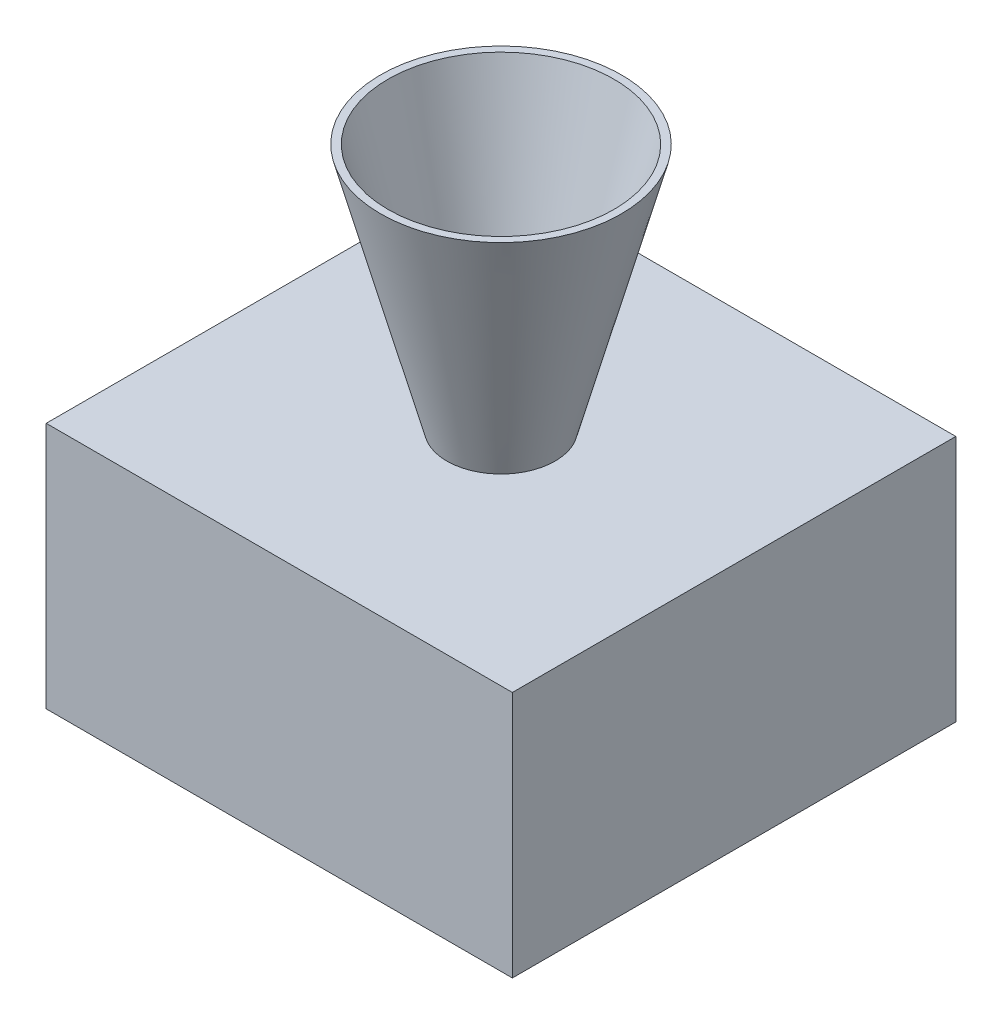
ISO-10303-21;
HEADER;
FILE_DESCRIPTION(('STEP AP214'),'2;1');
FILE_NAME('part.step','',(''),(''),'','','');
FILE_SCHEMA(('AUTOMOTIVE_DESIGN { 1 0 10303 214 1 1 1 1 }'));
ENDSEC;
DATA;
#1=APPLICATION_CONTEXT('core data for automotive mechanical design processes');
#2=APPLICATION_PROTOCOL_DEFINITION('international standard','automotive_design',2000,#1);
#3=PRODUCT_CONTEXT('',#1,'mechanical');
#4=PRODUCT('Part','Part','',(#3));
#5=PRODUCT_RELATED_PRODUCT_CATEGORY('part','',(#4));
#6=PRODUCT_DEFINITION_FORMATION('','',#4);
#7=PRODUCT_DEFINITION_CONTEXT('part definition',#1,'design');
#8=PRODUCT_DEFINITION('design','',#6,#7);
#9=PRODUCT_DEFINITION_SHAPE('','',#8);
#10=(LENGTH_UNIT() NAMED_UNIT(*) SI_UNIT(.MILLI.,.METRE.));
#11=(NAMED_UNIT(*) PLANE_ANGLE_UNIT() SI_UNIT($,.RADIAN.));
#12=(NAMED_UNIT(*) SI_UNIT($,.STERADIAN.) SOLID_ANGLE_UNIT());
#13=UNCERTAINTY_MEASURE_WITH_UNIT(LENGTH_MEASURE(1.E-05),#10,'distance_accuracy_value','');
#14=(GEOMETRIC_REPRESENTATION_CONTEXT(3) GLOBAL_UNCERTAINTY_ASSIGNED_CONTEXT((#13)) GLOBAL_UNIT_ASSIGNED_CONTEXT((#10,
#11,#12)) REPRESENTATION_CONTEXT('',''));
#15=CARTESIAN_POINT('',(0.,0.,0.));
#16=DIRECTION('',(0.,0.,1.));
#17=DIRECTION('',(1.,0.,0.));
#18=AXIS2_PLACEMENT_3D('',#15,#16,#17);
#19=CARTESIAN_POINT('',(-82.,87.,-78.));
#20=DIRECTION('',(1.,0.,0.));
#21=DIRECTION('',(0.,0.,-1.));
#22=AXIS2_PLACEMENT_3D('',#19,#20,#21);
#23=PLANE('',#22);
#24=DIRECTION('',(0.,0.,1.));
#25=VECTOR('',#24,1.);
#26=CARTESIAN_POINT('',(-82.,0.,-78.));
#27=LINE('',#26,#25);
#28=CARTESIAN_POINT('',(-82.,0.,-78.));
#29=VERTEX_POINT('',#28);
#30=CARTESIAN_POINT('',(-82.,0.,78.));
#31=VERTEX_POINT('',#30);
#32=EDGE_CURVE('E167',#29,#31,#27,.T.);
#33=ORIENTED_EDGE('',*,*,#32,.T.);
#34=DIRECTION('',(0.,-1.,0.));
#35=VECTOR('',#34,1.);
#36=CARTESIAN_POINT('',(-82.,87.,78.));
#37=LINE('',#36,#35);
#38=CARTESIAN_POINT('',(-82.,87.,78.));
#39=VERTEX_POINT('',#38);
#40=EDGE_CURVE('E43',#39,#31,#37,.T.);
#41=ORIENTED_EDGE('',*,*,#40,.F.);
#42=DIRECTION('',(0.,0.,1.));
#43=VECTOR('',#42,1.);
#44=CARTESIAN_POINT('',(-82.,87.,-78.));
#45=LINE('',#44,#43);
#46=CARTESIAN_POINT('',(-82.,87.,-78.));
#47=VERTEX_POINT('',#46);
#48=EDGE_CURVE('E168',#47,#39,#45,.T.);
#49=ORIENTED_EDGE('',*,*,#48,.F.);
#50=DIRECTION('',(0.,-1.,0.));
#51=VECTOR('',#50,1.);
#52=CARTESIAN_POINT('',(-82.,87.,-78.));
#53=LINE('',#52,#51);
#54=EDGE_CURVE('E58',#47,#29,#53,.T.);
#55=ORIENTED_EDGE('',*,*,#54,.T.);
#56=EDGE_LOOP('',(#33,#41,#49,#55));
#57=FACE_BOUND('',#56,.T.);
#58=ADVANCED_FACE('F40',(#57),#23,.F.);
#59=CARTESIAN_POINT('',(-82.,87.,78.));
#60=DIRECTION('',(0.,0.,-1.));
#61=DIRECTION('',(-1.,0.,0.));
#62=AXIS2_PLACEMENT_3D('',#59,#60,#61);
#63=PLANE('',#62);
#64=DIRECTION('',(1.,0.,0.));
#65=VECTOR('',#64,1.);
#66=CARTESIAN_POINT('',(-82.,0.,78.));
#67=LINE('',#66,#65);
#68=CARTESIAN_POINT('',(82.,0.,78.));
#69=VERTEX_POINT('',#68);
#70=EDGE_CURVE('E183',#31,#69,#67,.T.);
#71=ORIENTED_EDGE('',*,*,#70,.T.);
#72=DIRECTION('',(0.,-1.,0.));
#73=VECTOR('',#72,1.);
#74=CARTESIAN_POINT('',(82.,87.,78.));
#75=LINE('',#74,#73);
#76=CARTESIAN_POINT('',(82.,87.,78.));
#77=VERTEX_POINT('',#76);
#78=EDGE_CURVE('E197',#77,#69,#75,.T.);
#79=ORIENTED_EDGE('',*,*,#78,.F.);
#80=DIRECTION('',(1.,0.,0.));
#81=VECTOR('',#80,1.);
#82=CARTESIAN_POINT('',(-82.,87.,78.));
#83=LINE('',#82,#81);
#84=EDGE_CURVE('E85',#39,#77,#83,.T.);
#85=ORIENTED_EDGE('',*,*,#84,.F.);
#86=ORIENTED_EDGE('',*,*,#40,.T.);
#87=EDGE_LOOP('',(#71,#79,#85,#86));
#88=FACE_BOUND('',#87,.T.);
#89=ADVANCED_FACE('F202',(#88),#63,.F.);
#90=CARTESIAN_POINT('',(82.,87.,-78.));
#91=DIRECTION('',(1.,0.,0.));
#92=DIRECTION('',(0.,0.,-1.));
#93=AXIS2_PLACEMENT_3D('',#90,#91,#92);
#94=PLANE('',#93);
#95=DIRECTION('',(0.,0.,1.));
#96=VECTOR('',#95,1.);
#97=CARTESIAN_POINT('',(82.,0.,-78.));
#98=LINE('',#97,#96);
#99=CARTESIAN_POINT('',(82.,0.,-78.));
#100=VERTEX_POINT('',#99);
#101=EDGE_CURVE('E187',#100,#69,#98,.T.);
#102=ORIENTED_EDGE('',*,*,#101,.F.);
#103=DIRECTION('',(0.,-1.,0.));
#104=VECTOR('',#103,1.);
#105=CARTESIAN_POINT('',(82.,87.,-78.));
#106=LINE('',#105,#104);
#107=CARTESIAN_POINT('',(82.,87.,-78.));
#108=VERTEX_POINT('',#107);
#109=EDGE_CURVE('E73',#108,#100,#106,.T.);
#110=ORIENTED_EDGE('',*,*,#109,.F.);
#111=DIRECTION('',(0.,0.,1.));
#112=VECTOR('',#111,1.);
#113=CARTESIAN_POINT('',(82.,87.,-78.));
#114=LINE('',#113,#112);
#115=EDGE_CURVE('E174',#108,#77,#114,.T.);
#116=ORIENTED_EDGE('',*,*,#115,.T.);
#117=ORIENTED_EDGE('',*,*,#78,.T.);
#118=EDGE_LOOP('',(#102,#110,#116,#117));
#119=FACE_BOUND('',#118,.T.);
#120=ADVANCED_FACE('F208',(#119),#94,.T.);
#121=CARTESIAN_POINT('',(-82.,87.,-78.));
#122=DIRECTION('',(0.,0.,-1.));
#123=DIRECTION('',(-1.,0.,0.));
#124=AXIS2_PLACEMENT_3D('',#121,#122,#123);
#125=PLANE('',#124);
#126=DIRECTION('',(1.,0.,0.));
#127=VECTOR('',#126,1.);
#128=CARTESIAN_POINT('',(-82.,0.,-78.));
#129=LINE('',#128,#127);
#130=EDGE_CURVE('E171',#29,#100,#129,.T.);
#131=ORIENTED_EDGE('',*,*,#130,.F.);
#132=ORIENTED_EDGE('',*,*,#54,.F.);
#133=DIRECTION('',(1.,0.,0.));
#134=VECTOR('',#133,1.);
#135=CARTESIAN_POINT('',(-82.,87.,-78.));
#136=LINE('',#135,#134);
#137=EDGE_CURVE('E178',#47,#108,#136,.T.);
#138=ORIENTED_EDGE('',*,*,#137,.T.);
#139=ORIENTED_EDGE('',*,*,#109,.T.);
#140=EDGE_LOOP('',(#131,#132,#138,#139));
#141=FACE_BOUND('',#140,.T.);
#142=ADVANCED_FACE('F205',(#141),#125,.T.);
#143=CARTESIAN_POINT('',(0.,87.,0.));
#144=DIRECTION('',(0.,1.,0.));
#145=DIRECTION('',(0.,0.,1.));
#146=AXIS2_PLACEMENT_3D('',#143,#144,#145);
#147=PLANE('',#146);
#148=CARTESIAN_POINT('',(0.,87.,0.));
#149=DIRECTION('',(0.,1.,0.));
#150=DIRECTION('',(0.,0.,1.));
#151=AXIS2_PLACEMENT_3D('',#148,#149,#150);
#152=CIRCLE('',#151,19.05);
#153=CARTESIAN_POINT('',(0.,87.,19.05));
#154=VERTEX_POINT('',#153);
#155=EDGE_CURVE('E11',#154,#154,#152,.T.);
#156=ORIENTED_EDGE('',*,*,#155,.F.);
#157=EDGE_LOOP('',(#156));
#158=FACE_BOUND('',#157,.T.);
#159=ORIENTED_EDGE('',*,*,#48,.T.);
#160=ORIENTED_EDGE('',*,*,#84,.T.);
#161=ORIENTED_EDGE('',*,*,#115,.F.);
#162=ORIENTED_EDGE('',*,*,#137,.F.);
#163=EDGE_LOOP('',(#159,#160,#161,#162));
#164=FACE_BOUND('',#163,.T.);
#165=ADVANCED_FACE('F207',(#158,#164),#147,.T.);
#166=CARTESIAN_POINT('',(0.,0.,0.));
#167=DIRECTION('',(0.,1.,0.));
#168=DIRECTION('',(0.,0.,1.));
#169=AXIS2_PLACEMENT_3D('',#166,#167,#168);
#170=PLANE('',#169);
#171=ORIENTED_EDGE('',*,*,#32,.F.);
#172=ORIENTED_EDGE('',*,*,#130,.T.);
#173=ORIENTED_EDGE('',*,*,#101,.T.);
#174=ORIENTED_EDGE('',*,*,#70,.F.);
#175=EDGE_LOOP('',(#171,#172,#173,#174));
#176=FACE_BOUND('',#175,.T.);
#177=ADVANCED_FACE('F204',(#176),#170,.F.);
#178=CARTESIAN_POINT('',(0.,87.,0.));
#179=DIRECTION('',(0.,1.,0.));
#180=DIRECTION('',(0.,0.,1.));
#181=AXIS2_PLACEMENT_3D('',#178,#179,#180);
#182=CONICAL_SURFACE('',#181,19.05,0.26179938779915);
#183=CARTESIAN_POINT('',(0.,174.,0.));
#184=DIRECTION('',(0.,1.,0.));
#185=DIRECTION('',(0.,0.,1.));
#186=AXIS2_PLACEMENT_3D('',#183,#184,#185);
#187=CIRCLE('',#186,42.3615797415077);
#188=CARTESIAN_POINT('',(0.,174.,42.3615797415077));
#189=VERTEX_POINT('',#188);
#190=EDGE_CURVE('E160',#189,#189,#187,.T.);
#191=ORIENTED_EDGE('',*,*,#190,.F.);
#192=EDGE_LOOP('',(#191));
#193=FACE_BOUND('',#192,.T.);
#194=ORIENTED_EDGE('',*,*,#155,.T.);
#195=EDGE_LOOP('',(#194));
#196=FACE_BOUND('',#195,.T.);
#197=ADVANCED_FACE('F242',(#193,#196),#182,.T.);
#198=CARTESIAN_POINT('',(0.,174.,0.));
#199=DIRECTION('',(0.,1.,0.));
#200=DIRECTION('',(0.,0.,1.));
#201=AXIS2_PLACEMENT_3D('',#198,#199,#200);
#202=PLANE('',#201);
#203=CARTESIAN_POINT('',(0.,174.,0.));
#204=DIRECTION('',(0.,1.,0.));
#205=DIRECTION('',(0.,0.,1.));
#206=AXIS2_PLACEMENT_3D('',#203,#204,#205);
#207=CIRCLE('',#206,39.7319782432661);
#208=CARTESIAN_POINT('',(0.,174.,39.7319782432661));
#209=VERTEX_POINT('',#208);
#210=EDGE_CURVE('E136',#209,#209,#207,.T.);
#211=ORIENTED_EDGE('',*,*,#210,.F.);
#212=EDGE_LOOP('',(#211));
#213=FACE_BOUND('',#212,.T.);
#214=ORIENTED_EDGE('',*,*,#190,.T.);
#215=EDGE_LOOP('',(#214));
#216=FACE_BOUND('',#215,.T.);
#217=ADVANCED_FACE('F255',(#213,#216),#202,.T.);
#218=CARTESIAN_POINT('',(-79.46,87.,-78.));
#219=DIRECTION('',(1.,0.,0.));
#220=DIRECTION('',(0.,0.,-1.));
#221=AXIS2_PLACEMENT_3D('',#218,#219,#220);
#222=PLANE('',#221);
#223=DIRECTION('',(0.,0.,1.));
#224=VECTOR('',#223,1.);
#225=CARTESIAN_POINT('',(-79.46,2.54,-78.));
#226=LINE('',#225,#224);
#227=CARTESIAN_POINT('',(-79.46,2.54,-75.46));
#228=VERTEX_POINT('',#227);
#229=CARTESIAN_POINT('',(-79.46,2.54,75.46));
#230=VERTEX_POINT('',#229);
#231=EDGE_CURVE('E128',#228,#230,#226,.T.);
#232=ORIENTED_EDGE('',*,*,#231,.F.);
#233=DIRECTION('',(0.,-1.,0.));
#234=VECTOR('',#233,1.);
#235=CARTESIAN_POINT('',(-79.46,87.,-75.46));
#236=LINE('',#235,#234);
#237=CARTESIAN_POINT('',(-79.46,84.46,-75.46));
#238=VERTEX_POINT('',#237);
#239=EDGE_CURVE('E113',#238,#228,#236,.T.);
#240=ORIENTED_EDGE('',*,*,#239,.F.);
#241=DIRECTION('',(0.,0.,1.));
#242=VECTOR('',#241,1.);
#243=CARTESIAN_POINT('',(-79.46,84.46,-78.));
#244=LINE('',#243,#242);
#245=CARTESIAN_POINT('',(-79.46,84.46,75.46));
#246=VERTEX_POINT('',#245);
#247=EDGE_CURVE('E143',#238,#246,#244,.T.);
#248=ORIENTED_EDGE('',*,*,#247,.T.);
#249=DIRECTION('',(0.,-1.,0.));
#250=VECTOR('',#249,1.);
#251=CARTESIAN_POINT('',(-79.46,87.,75.46));
#252=LINE('',#251,#250);
#253=EDGE_CURVE('E131',#246,#230,#252,.T.);
#254=ORIENTED_EDGE('',*,*,#253,.T.);
#255=EDGE_LOOP('',(#232,#240,#248,#254));
#256=FACE_BOUND('',#255,.T.);
#257=ADVANCED_FACE('F129',(#256),#222,.T.);
#258=CARTESIAN_POINT('',(-82.,87.,75.46));
#259=DIRECTION('',(0.,0.,-1.));
#260=DIRECTION('',(-1.,0.,0.));
#261=AXIS2_PLACEMENT_3D('',#258,#259,#260);
#262=PLANE('',#261);
#263=DIRECTION('',(1.,0.,0.));
#264=VECTOR('',#263,1.);
#265=CARTESIAN_POINT('',(-82.,2.54,75.46));
#266=LINE('',#265,#264);
#267=CARTESIAN_POINT('',(79.46,2.54,75.46));
#268=VERTEX_POINT('',#267);
#269=EDGE_CURVE('E135',#230,#268,#266,.T.);
#270=ORIENTED_EDGE('',*,*,#269,.F.);
#271=ORIENTED_EDGE('',*,*,#253,.F.);
#272=DIRECTION('',(1.,0.,0.));
#273=VECTOR('',#272,1.);
#274=CARTESIAN_POINT('',(-82.,84.46,75.46));
#275=LINE('',#274,#273);
#276=CARTESIAN_POINT('',(79.46,84.46,75.46));
#277=VERTEX_POINT('',#276);
#278=EDGE_CURVE('E147',#246,#277,#275,.T.);
#279=ORIENTED_EDGE('',*,*,#278,.T.);
#280=DIRECTION('',(0.,-1.,0.));
#281=VECTOR('',#280,1.);
#282=CARTESIAN_POINT('',(79.46,87.,75.46));
#283=LINE('',#282,#281);
#284=EDGE_CURVE('E340',#277,#268,#283,.T.);
#285=ORIENTED_EDGE('',*,*,#284,.T.);
#286=EDGE_LOOP('',(#270,#271,#279,#285));
#287=FACE_BOUND('',#286,.T.);
#288=ADVANCED_FACE('F274',(#287),#262,.T.);
#289=CARTESIAN_POINT('',(79.46,87.,-78.));
#290=DIRECTION('',(1.,0.,0.));
#291=DIRECTION('',(0.,0.,-1.));
#292=AXIS2_PLACEMENT_3D('',#289,#290,#291);
#293=PLANE('',#292);
#294=DIRECTION('',(0.,0.,1.));
#295=VECTOR('',#294,1.);
#296=CARTESIAN_POINT('',(79.46,2.54,-78.));
#297=LINE('',#296,#295);
#298=CARTESIAN_POINT('',(79.46,2.54,-75.46));
#299=VERTEX_POINT('',#298);
#300=EDGE_CURVE('E141',#299,#268,#297,.T.);
#301=ORIENTED_EDGE('',*,*,#300,.T.);
#302=ORIENTED_EDGE('',*,*,#284,.F.);
#303=DIRECTION('',(0.,0.,1.));
#304=VECTOR('',#303,1.);
#305=CARTESIAN_POINT('',(79.46,84.46,-78.));
#306=LINE('',#305,#304);
#307=CARTESIAN_POINT('',(79.46,84.46,-75.46));
#308=VERTEX_POINT('',#307);
#309=EDGE_CURVE('E152',#308,#277,#306,.T.);
#310=ORIENTED_EDGE('',*,*,#309,.F.);
#311=DIRECTION('',(0.,-1.,0.));
#312=VECTOR('',#311,1.);
#313=CARTESIAN_POINT('',(79.46,87.,-75.46));
#314=LINE('',#313,#312);
#315=EDGE_CURVE('E124',#308,#299,#314,.T.);
#316=ORIENTED_EDGE('',*,*,#315,.T.);
#317=EDGE_LOOP('',(#301,#302,#310,#316));
#318=FACE_BOUND('',#317,.T.);
#319=ADVANCED_FACE('F283',(#318),#293,.F.);
#320=CARTESIAN_POINT('',(-82.,87.,-75.46));
#321=DIRECTION('',(0.,0.,-1.));
#322=DIRECTION('',(-1.,0.,0.));
#323=AXIS2_PLACEMENT_3D('',#320,#321,#322);
#324=PLANE('',#323);
#325=DIRECTION('',(1.,0.,0.));
#326=VECTOR('',#325,1.);
#327=CARTESIAN_POINT('',(-82.,2.54,-75.46));
#328=LINE('',#327,#326);
#329=EDGE_CURVE('E117',#228,#299,#328,.T.);
#330=ORIENTED_EDGE('',*,*,#329,.T.);
#331=ORIENTED_EDGE('',*,*,#315,.F.);
#332=DIRECTION('',(1.,0.,0.));
#333=VECTOR('',#332,1.);
#334=CARTESIAN_POINT('',(-82.,84.46,-75.46));
#335=LINE('',#334,#333);
#336=EDGE_CURVE('E119',#238,#308,#335,.T.);
#337=ORIENTED_EDGE('',*,*,#336,.F.);
#338=ORIENTED_EDGE('',*,*,#239,.T.);
#339=EDGE_LOOP('',(#330,#331,#337,#338));
#340=FACE_BOUND('',#339,.T.);
#341=ADVANCED_FACE('F115',(#340),#324,.F.);
#342=CARTESIAN_POINT('',(0.,84.46,0.));
#343=DIRECTION('',(0.,1.,0.));
#344=DIRECTION('',(0.,0.,1.));
#345=AXIS2_PLACEMENT_3D('',#342,#343,#344);
#346=PLANE('',#345);
#347=CARTESIAN_POINT('',(0.,84.46,0.));
#348=DIRECTION('',(0.,1.,0.));
#349=DIRECTION('',(0.,0.,1.));
#350=AXIS2_PLACEMENT_3D('',#347,#348,#349);
#351=CIRCLE('',#350,15.7398075529833);
#352=CARTESIAN_POINT('',(0.,84.46,15.7398075529833));
#353=VERTEX_POINT('',#352);
#354=EDGE_CURVE('E156',#353,#353,#351,.T.);
#355=ORIENTED_EDGE('',*,*,#354,.T.);
#356=EDGE_LOOP('',(#355));
#357=FACE_BOUND('',#356,.T.);
#358=ORIENTED_EDGE('',*,*,#247,.F.);
#359=ORIENTED_EDGE('',*,*,#336,.T.);
#360=ORIENTED_EDGE('',*,*,#309,.T.);
#361=ORIENTED_EDGE('',*,*,#278,.F.);
#362=EDGE_LOOP('',(#358,#359,#360,#361));
#363=FACE_BOUND('',#362,.T.);
#364=ADVANCED_FACE('F302',(#357,#363),#346,.F.);
#365=CARTESIAN_POINT('',(0.,2.54,0.));
#366=DIRECTION('',(0.,1.,0.));
#367=DIRECTION('',(0.,0.,1.));
#368=AXIS2_PLACEMENT_3D('',#365,#366,#367);
#369=PLANE('',#368);
#370=ORIENTED_EDGE('',*,*,#231,.T.);
#371=ORIENTED_EDGE('',*,*,#269,.T.);
#372=ORIENTED_EDGE('',*,*,#300,.F.);
#373=ORIENTED_EDGE('',*,*,#329,.F.);
#374=EDGE_LOOP('',(#370,#371,#372,#373));
#375=FACE_BOUND('',#374,.T.);
#376=ADVANCED_FACE('F139',(#375),#369,.T.);
#377=CARTESIAN_POINT('',(0.,87.6574003745604,0.));
#378=DIRECTION('',(0.,1.,0.));
#379=DIRECTION('',(0.,0.,1.));
#380=AXIS2_PLACEMENT_3D('',#377,#378,#379);
#381=CONICAL_SURFACE('',#380,16.5965484012258,0.26179938779915);
#382=ORIENTED_EDGE('',*,*,#210,.T.);
#383=EDGE_LOOP('',(#382));
#384=FACE_BOUND('',#383,.T.);
#385=ORIENTED_EDGE('',*,*,#354,.F.);
#386=EDGE_LOOP('',(#385));
#387=FACE_BOUND('',#386,.T.);
#388=ADVANCED_FACE('F320',(#384,#387),#381,.F.);
#389=CLOSED_SHELL('',(#58,#89,#120,#142,#165,#177,#197,#217,#257,#288,#319,#341,#364,#376,#388));
#390=MANIFOLD_SOLID_BREP('B2',#389);
#391=ADVANCED_BREP_SHAPE_REPRESENTATION('',(#18,#390),#14);
#392=SHAPE_DEFINITION_REPRESENTATION(#9,#391);
ENDSEC;
END-ISO-10303-21;
